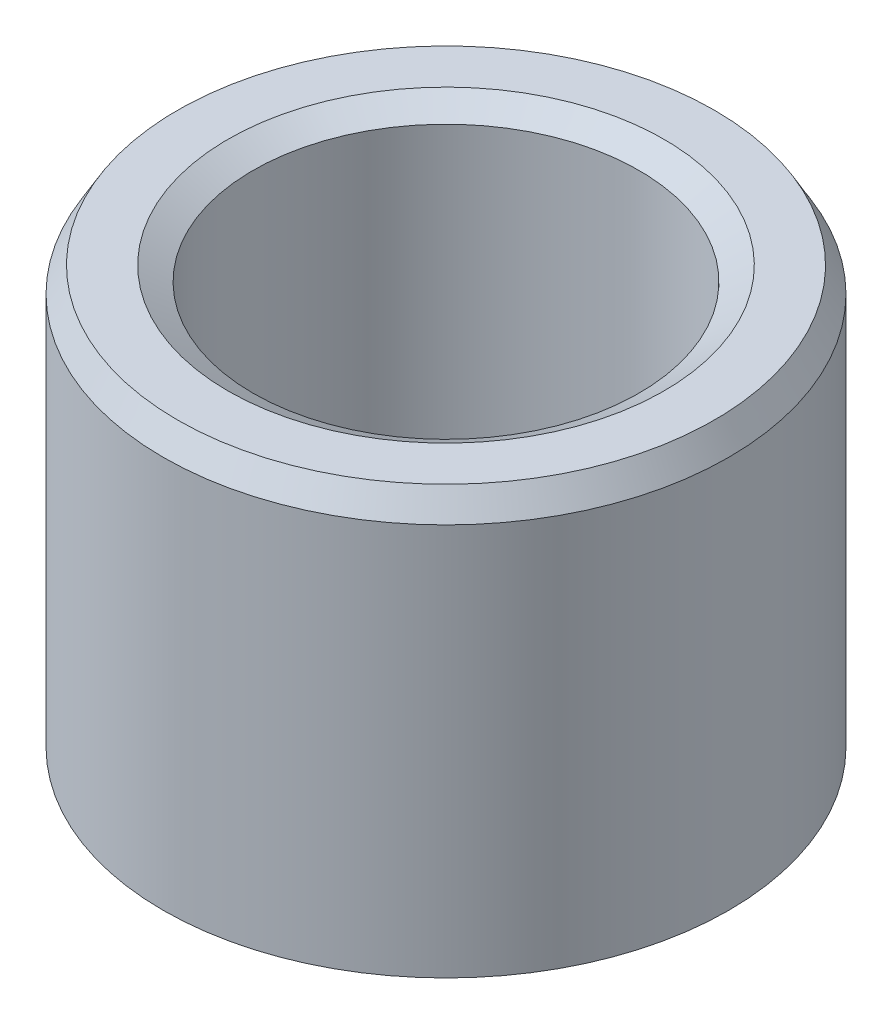
ISO-10303-21;
HEADER;
FILE_DESCRIPTION(('STEP AP214'),'2;1');
FILE_NAME('part.step','',(''),(''),'','','');
FILE_SCHEMA(('AUTOMOTIVE_DESIGN { 1 0 10303 214 1 1 1 1 }'));
ENDSEC;
DATA;
#1=APPLICATION_CONTEXT('core data for automotive mechanical design processes');
#2=APPLICATION_PROTOCOL_DEFINITION('international standard','automotive_design',2000,#1);
#3=PRODUCT_CONTEXT('',#1,'mechanical');
#4=PRODUCT('Part','Part','',(#3));
#5=PRODUCT_RELATED_PRODUCT_CATEGORY('part','',(#4));
#6=PRODUCT_DEFINITION_FORMATION('','',#4);
#7=PRODUCT_DEFINITION_CONTEXT('part definition',#1,'design');
#8=PRODUCT_DEFINITION('design','',#6,#7);
#9=PRODUCT_DEFINITION_SHAPE('','',#8);
#10=(LENGTH_UNIT() NAMED_UNIT(*) SI_UNIT(.MILLI.,.METRE.));
#11=(NAMED_UNIT(*) PLANE_ANGLE_UNIT() SI_UNIT($,.RADIAN.));
#12=(NAMED_UNIT(*) SI_UNIT($,.STERADIAN.) SOLID_ANGLE_UNIT());
#13=UNCERTAINTY_MEASURE_WITH_UNIT(LENGTH_MEASURE(1.E-05),#10,'distance_accuracy_value','');
#14=(GEOMETRIC_REPRESENTATION_CONTEXT(3) GLOBAL_UNCERTAINTY_ASSIGNED_CONTEXT((#13)) GLOBAL_UNIT_ASSIGNED_CONTEXT((#10,
#11,#12)) REPRESENTATION_CONTEXT('',''));
#15=CARTESIAN_POINT('',(0.,0.,0.));
#16=DIRECTION('',(0.,0.,1.));
#17=DIRECTION('',(1.,0.,0.));
#18=AXIS2_PLACEMENT_3D('',#15,#16,#17);
#19=CARTESIAN_POINT('',(0.,41.9849270930583,0.));
#20=DIRECTION('',(0.,-1.,0.));
#21=DIRECTION('',(0.,0.,-1.));
#22=AXIS2_PLACEMENT_3D('',#19,#20,#21);
#23=CYLINDRICAL_SURFACE('',#22,27.5);
#24=CARTESIAN_POINT('',(0.,1.40399265963501,0.));
#25=DIRECTION('',(0.,1.,0.));
#26=DIRECTION('',(0.,0.,1.));
#27=AXIS2_PLACEMENT_3D('',#24,#25,#26);
#28=CIRCLE('',#27,27.5);
#29=CARTESIAN_POINT('',(0.,1.40399265963501,27.5));
#30=VERTEX_POINT('',#29);
#31=EDGE_CURVE('E10',#30,#30,#28,.T.);
#32=ORIENTED_EDGE('',*,*,#31,.T.);
#33=EDGE_LOOP('',(#32));
#34=FACE_BOUND('',#33,.T.);
#35=CARTESIAN_POINT('',(0.,39.5531404731168,0.));
#36=DIRECTION('',(0.,1.,0.));
#37=DIRECTION('',(0.,0.,1.));
#38=AXIS2_PLACEMENT_3D('',#35,#36,#37);
#39=CIRCLE('',#38,27.5);
#40=CARTESIAN_POINT('',(0.,39.5531404731168,27.5));
#41=VERTEX_POINT('',#40);
#42=EDGE_CURVE('E50',#41,#41,#39,.F.);
#43=ORIENTED_EDGE('',*,*,#42,.T.);
#44=EDGE_LOOP('',(#43));
#45=FACE_BOUND('',#44,.T.);
#46=ADVANCED_FACE('F39',(#34,#45),#23,.T.);
#47=CARTESIAN_POINT('',(0.,41.9849270930583,0.));
#48=DIRECTION('',(0.,1.,0.));
#49=DIRECTION('',(0.,0.,1.));
#50=AXIS2_PLACEMENT_3D('',#47,#48,#49);
#51=PLANE('',#50);
#52=CARTESIAN_POINT('',(0.,41.9849270930583,0.));
#53=DIRECTION('',(0.,1.,0.));
#54=DIRECTION('',(0.,0.,1.));
#55=AXIS2_PLACEMENT_3D('',#52,#53,#54);
#56=CIRCLE('',#55,21.1974987221116);
#57=CARTESIAN_POINT('',(0.,41.9849270930583,21.1974987221116));
#58=VERTEX_POINT('',#57);
#59=EDGE_CURVE('E58',#58,#58,#56,.F.);
#60=ORIENTED_EDGE('',*,*,#59,.T.);
#61=EDGE_LOOP('',(#60));
#62=FACE_BOUND('',#61,.T.);
#63=CARTESIAN_POINT('',(0.,41.9849270930583,0.));
#64=DIRECTION('',(0.,1.,0.));
#65=DIRECTION('',(0.,0.,1.));
#66=AXIS2_PLACEMENT_3D('',#63,#64,#65);
#67=CIRCLE('',#66,26.096007340365);
#68=CARTESIAN_POINT('',(0.,41.9849270930583,26.096007340365));
#69=VERTEX_POINT('',#68);
#70=EDGE_CURVE('E61',#69,#69,#67,.T.);
#71=ORIENTED_EDGE('',*,*,#70,.T.);
#72=EDGE_LOOP('',(#71));
#73=FACE_BOUND('',#72,.T.);
#74=ADVANCED_FACE('F88',(#62,#73),#51,.T.);
#75=CARTESIAN_POINT('',(0.,0.,0.));
#76=DIRECTION('',(0.,1.,0.));
#77=DIRECTION('',(0.,0.,1.));
#78=AXIS2_PLACEMENT_3D('',#75,#76,#77);
#79=PLANE('',#78);
#80=CARTESIAN_POINT('',(0.,0.,0.));
#81=DIRECTION('',(0.,1.,0.));
#82=DIRECTION('',(0.,0.,1.));
#83=AXIS2_PLACEMENT_3D('',#80,#81,#82);
#84=CIRCLE('',#83,20.169704761805);
#85=CARTESIAN_POINT('',(0.,0.,20.169704761805));
#86=VERTEX_POINT('',#85);
#87=EDGE_CURVE('E51',#86,#86,#84,.T.);
#88=ORIENTED_EDGE('',*,*,#87,.T.);
#89=EDGE_LOOP('',(#88));
#90=FACE_BOUND('',#89,.T.);
#91=CARTESIAN_POINT('',(0.,0.,0.));
#92=DIRECTION('',(0.,1.,0.));
#93=DIRECTION('',(0.,0.,1.));
#94=AXIS2_PLACEMENT_3D('',#91,#92,#93);
#95=CIRCLE('',#94,25.0682133800584);
#96=CARTESIAN_POINT('',(0.,0.,25.0682133800584));
#97=VERTEX_POINT('',#96);
#98=EDGE_CURVE('E54',#97,#97,#95,.F.);
#99=ORIENTED_EDGE('',*,*,#98,.T.);
#100=EDGE_LOOP('',(#99));
#101=FACE_BOUND('',#100,.T.);
#102=ADVANCED_FACE('F83',(#90,#101),#79,.F.);
#103=CARTESIAN_POINT('',(0.,41.9849270930583,0.));
#104=DIRECTION('',(0.,-1.,0.));
#105=DIRECTION('',(0.,0.,-1.));
#106=AXIS2_PLACEMENT_3D('',#103,#104,#105);
#107=CYLINDRICAL_SURFACE('',#106,18.76571210217);
#108=CARTESIAN_POINT('',(0.,40.5809344334233,0.));
#109=DIRECTION('',(0.,1.,0.));
#110=DIRECTION('',(0.,0.,1.));
#111=AXIS2_PLACEMENT_3D('',#108,#109,#110);
#112=CIRCLE('',#111,18.76571210217);
#113=CARTESIAN_POINT('',(0.,40.5809344334233,18.76571210217));
#114=VERTEX_POINT('',#113);
#115=EDGE_CURVE('E67',#114,#114,#112,.T.);
#116=ORIENTED_EDGE('',*,*,#115,.T.);
#117=EDGE_LOOP('',(#116));
#118=FACE_BOUND('',#117,.T.);
#119=CARTESIAN_POINT('',(0.,2.43178661994158,0.));
#120=DIRECTION('',(0.,1.,0.));
#121=DIRECTION('',(0.,0.,1.));
#122=AXIS2_PLACEMENT_3D('',#119,#120,#121);
#123=CIRCLE('',#122,18.76571210217);
#124=CARTESIAN_POINT('',(0.,2.43178661994158,18.76571210217));
#125=VERTEX_POINT('',#124);
#126=EDGE_CURVE('E69',#125,#125,#123,.F.);
#127=ORIENTED_EDGE('',*,*,#126,.T.);
#128=EDGE_LOOP('',(#127));
#129=FACE_BOUND('',#128,.T.);
#130=ADVANCED_FACE('F71',(#118,#129),#107,.F.);
#131=CARTESIAN_POINT('',(0.,40.5809344334233,0.));
#132=DIRECTION('',(0.,1.,0.));
#133=DIRECTION('',(0.,0.,1.));
#134=AXIS2_PLACEMENT_3D('',#131,#132,#133);
#135=CONICAL_SURFACE('',#134,18.76571210217,1.0471975511966);
#136=ORIENTED_EDGE('',*,*,#59,.F.);
#137=EDGE_LOOP('',(#136));
#138=FACE_BOUND('',#137,.T.);
#139=ORIENTED_EDGE('',*,*,#115,.F.);
#140=EDGE_LOOP('',(#139));
#141=FACE_BOUND('',#140,.T.);
#142=ADVANCED_FACE('F77',(#138,#141),#135,.F.);
#143=CARTESIAN_POINT('',(0.,0.,0.));
#144=DIRECTION('',(0.,-1.,0.));
#145=DIRECTION('',(0.,0.,-1.));
#146=AXIS2_PLACEMENT_3D('',#143,#144,#145);
#147=CONICAL_SURFACE('',#146,20.169704761805,0.523598775598294);
#148=ORIENTED_EDGE('',*,*,#126,.F.);
#149=EDGE_LOOP('',(#148));
#150=FACE_BOUND('',#149,.T.);
#151=ORIENTED_EDGE('',*,*,#87,.F.);
#152=EDGE_LOOP('',(#151));
#153=FACE_BOUND('',#152,.T.);
#154=ADVANCED_FACE('F73',(#150,#153),#147,.F.);
#155=CARTESIAN_POINT('',(0.,1.40399265963501,0.));
#156=DIRECTION('',(0.,1.,0.));
#157=DIRECTION('',(0.,0.,1.));
#158=AXIS2_PLACEMENT_3D('',#155,#156,#157);
#159=CONICAL_SURFACE('',#158,27.5,1.0471975511966);
#160=ORIENTED_EDGE('',*,*,#98,.F.);
#161=EDGE_LOOP('',(#160));
#162=FACE_BOUND('',#161,.T.);
#163=ORIENTED_EDGE('',*,*,#31,.F.);
#164=EDGE_LOOP('',(#163));
#165=FACE_BOUND('',#164,.T.);
#166=ADVANCED_FACE('F76',(#162,#165),#159,.T.);
#167=CARTESIAN_POINT('',(0.,41.9849270930583,0.));
#168=DIRECTION('',(0.,-1.,0.));
#169=DIRECTION('',(0.,0.,-1.));
#170=AXIS2_PLACEMENT_3D('',#167,#168,#169);
#171=CONICAL_SURFACE('',#170,26.096007340365,0.523598775598294);
#172=ORIENTED_EDGE('',*,*,#42,.F.);
#173=EDGE_LOOP('',(#172));
#174=FACE_BOUND('',#173,.T.);
#175=ORIENTED_EDGE('',*,*,#70,.F.);
#176=EDGE_LOOP('',(#175));
#177=FACE_BOUND('',#176,.T.);
#178=ADVANCED_FACE('F45',(#174,#177),#171,.T.);
#179=CLOSED_SHELL('',(#46,#74,#102,#130,#142,#154,#166,#178));
#180=MANIFOLD_SOLID_BREP('B2',#179);
#181=ADVANCED_BREP_SHAPE_REPRESENTATION('',(#18,#180),#14);
#182=SHAPE_DEFINITION_REPRESENTATION(#9,#181);
ENDSEC;
END-ISO-10303-21;
